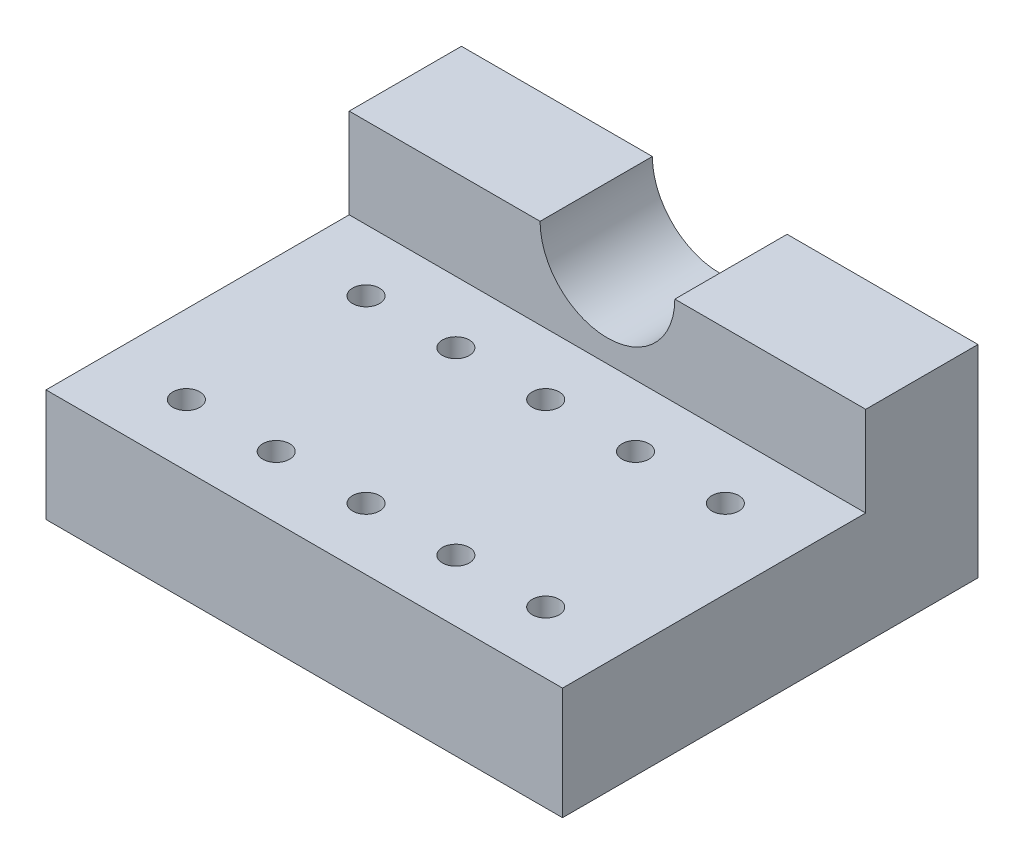
ISO-10303-21;
HEADER;
FILE_DESCRIPTION(('STEP AP214'),'2;1');
FILE_NAME('part.step','',(''),(''),'','','');
FILE_SCHEMA(('AUTOMOTIVE_DESIGN { 1 0 10303 214 1 1 1 1 }'));
ENDSEC;
DATA;
#1=APPLICATION_CONTEXT('core data for automotive mechanical design processes');
#2=APPLICATION_PROTOCOL_DEFINITION('international standard','automotive_design',2000,#1);
#3=PRODUCT_CONTEXT('',#1,'mechanical');
#4=PRODUCT('Part','Part','',(#3));
#5=PRODUCT_RELATED_PRODUCT_CATEGORY('part','',(#4));
#6=PRODUCT_DEFINITION_FORMATION('','',#4);
#7=PRODUCT_DEFINITION_CONTEXT('part definition',#1,'design');
#8=PRODUCT_DEFINITION('design','',#6,#7);
#9=PRODUCT_DEFINITION_SHAPE('','',#8);
#10=(LENGTH_UNIT() NAMED_UNIT(*) SI_UNIT(.MILLI.,.METRE.));
#11=(NAMED_UNIT(*) PLANE_ANGLE_UNIT() SI_UNIT($,.RADIAN.));
#12=(NAMED_UNIT(*) SI_UNIT($,.STERADIAN.) SOLID_ANGLE_UNIT());
#13=UNCERTAINTY_MEASURE_WITH_UNIT(LENGTH_MEASURE(1.E-05),#10,'distance_accuracy_value','');
#14=(GEOMETRIC_REPRESENTATION_CONTEXT(3) GLOBAL_UNCERTAINTY_ASSIGNED_CONTEXT((#13)) GLOBAL_UNIT_ASSIGNED_CONTEXT((#10,
#11,#12)) REPRESENTATION_CONTEXT('',''));
#15=CARTESIAN_POINT('',(0.,0.,0.));
#16=DIRECTION('',(0.,0.,1.));
#17=DIRECTION('',(1.,0.,0.));
#18=AXIS2_PLACEMENT_3D('',#15,#16,#17);
#19=CARTESIAN_POINT('',(23.,18.,13.51));
#20=DIRECTION('',(0.,-1.,0.));
#21=DIRECTION('',(0.,0.,-1.));
#22=AXIS2_PLACEMENT_3D('',#19,#20,#21);
#23=PLANE('',#22);
#24=DIRECTION('',(1.,0.,0.));
#25=VECTOR('',#24,1.);
#26=CARTESIAN_POINT('',(23.,18.,-13.5));
#27=LINE('',#26,#25);
#28=CARTESIAN_POINT('',(-23.,18.,-13.5));
#29=VERTEX_POINT('',#28);
#30=CARTESIAN_POINT('',(-6.,18.,-13.5));
#31=VERTEX_POINT('',#30);
#32=EDGE_CURVE('E213',#29,#31,#27,.T.);
#33=ORIENTED_EDGE('',*,*,#32,.T.);
#34=DIRECTION('',(0.,0.,-1.));
#35=VECTOR('',#34,1.);
#36=CARTESIAN_POINT('',(-6.,18.,6.49999999999999));
#37=LINE('',#36,#35);
#38=CARTESIAN_POINT('',(-6.,18.,-23.5));
#39=VERTEX_POINT('',#38);
#40=EDGE_CURVE('E210',#39,#31,#37,.F.);
#41=ORIENTED_EDGE('',*,*,#40,.F.);
#42=DIRECTION('',(-1.,0.,0.));
#43=VECTOR('',#42,1.);
#44=CARTESIAN_POINT('',(23.,18.,-23.5));
#45=LINE('',#44,#43);
#46=CARTESIAN_POINT('',(-23.,18.,-23.5));
#47=VERTEX_POINT('',#46);
#48=EDGE_CURVE('E11',#39,#47,#45,.T.);
#49=ORIENTED_EDGE('',*,*,#48,.T.);
#50=DIRECTION('',(0.,0.,-1.));
#51=VECTOR('',#50,1.);
#52=CARTESIAN_POINT('',(-23.,18.,13.51));
#53=LINE('',#52,#51);
#54=EDGE_CURVE('E49',#29,#47,#53,.T.);
#55=ORIENTED_EDGE('',*,*,#54,.F.);
#56=EDGE_LOOP('',(#33,#41,#49,#55));
#57=FACE_BOUND('',#56,.T.);
#58=ADVANCED_FACE('F32',(#57),#23,.F.);
#59=CARTESIAN_POINT('',(6.,18.,-13.5));
#60=VERTEX_POINT('',#59);
#61=CARTESIAN_POINT('',(23.,18.,-13.5));
#62=VERTEX_POINT('',#61);
#63=EDGE_CURVE('E36',#60,#62,#27,.T.);
#64=ORIENTED_EDGE('',*,*,#63,.T.);
#65=DIRECTION('',(0.,0.,1.));
#66=VECTOR('',#65,1.);
#67=CARTESIAN_POINT('',(23.,18.,-13.5));
#68=LINE('',#67,#66);
#69=CARTESIAN_POINT('',(23.,18.,-23.5));
#70=VERTEX_POINT('',#69);
#71=EDGE_CURVE('E211',#70,#62,#68,.T.);
#72=ORIENTED_EDGE('',*,*,#71,.F.);
#73=CARTESIAN_POINT('',(6.,18.,-23.5));
#74=VERTEX_POINT('',#73);
#75=EDGE_CURVE('E41',#70,#74,#45,.T.);
#76=ORIENTED_EDGE('',*,*,#75,.T.);
#77=DIRECTION('',(0.,0.,-1.));
#78=VECTOR('',#77,1.);
#79=CARTESIAN_POINT('',(6.,18.,6.49999999999999));
#80=LINE('',#79,#78);
#81=EDGE_CURVE('E208',#60,#74,#80,.T.);
#82=ORIENTED_EDGE('',*,*,#81,.F.);
#83=EDGE_LOOP('',(#64,#72,#76,#82));
#84=FACE_BOUND('',#83,.T.);
#85=ADVANCED_FACE('F34',(#84),#23,.F.);
#86=CARTESIAN_POINT('',(16.0000000000002,10.,8.));
#87=DIRECTION('',(0.,-1.,0.));
#88=DIRECTION('',(0.,0.,-1.));
#89=AXIS2_PLACEMENT_3D('',#86,#87,#88);
#90=CYLINDRICAL_SURFACE('',#89,1.2);
#91=CARTESIAN_POINT('',(16.0000000000002,10.,8.));
#92=DIRECTION('',(0.,1.,0.));
#93=DIRECTION('',(0.,0.,1.));
#94=AXIS2_PLACEMENT_3D('',#91,#92,#93);
#95=CIRCLE('',#94,1.2);
#96=CARTESIAN_POINT('',(16.0000000000002,10.,9.2));
#97=VERTEX_POINT('',#96);
#98=EDGE_CURVE('E131',#97,#97,#95,.T.);
#99=ORIENTED_EDGE('',*,*,#98,.T.);
#100=EDGE_LOOP('',(#99));
#101=FACE_BOUND('',#100,.T.);
#102=CARTESIAN_POINT('',(16.0000000000002,0.,8.));
#103=DIRECTION('',(0.,1.,0.));
#104=DIRECTION('',(0.,0.,1.));
#105=AXIS2_PLACEMENT_3D('',#102,#103,#104);
#106=CIRCLE('',#105,1.2);
#107=CARTESIAN_POINT('',(16.0000000000002,0.,9.2));
#108=VERTEX_POINT('',#107);
#109=EDGE_CURVE('E128',#108,#108,#106,.T.);
#110=ORIENTED_EDGE('',*,*,#109,.F.);
#111=EDGE_LOOP('',(#110));
#112=FACE_BOUND('',#111,.T.);
#113=ADVANCED_FACE('F252',(#101,#112),#90,.F.);
#114=CARTESIAN_POINT('',(8.00000000000016,10.,8.));
#115=DIRECTION('',(0.,-1.,0.));
#116=DIRECTION('',(0.,0.,-1.));
#117=AXIS2_PLACEMENT_3D('',#114,#115,#116);
#118=CYLINDRICAL_SURFACE('',#117,1.2);
#119=CARTESIAN_POINT('',(8.00000000000016,10.,8.));
#120=DIRECTION('',(0.,1.,0.));
#121=DIRECTION('',(0.,0.,1.));
#122=AXIS2_PLACEMENT_3D('',#119,#120,#121);
#123=CIRCLE('',#122,1.2);
#124=CARTESIAN_POINT('',(8.00000000000016,10.,9.2));
#125=VERTEX_POINT('',#124);
#126=EDGE_CURVE('E137',#125,#125,#123,.T.);
#127=ORIENTED_EDGE('',*,*,#126,.T.);
#128=EDGE_LOOP('',(#127));
#129=FACE_BOUND('',#128,.T.);
#130=CARTESIAN_POINT('',(8.00000000000016,0.,8.));
#131=DIRECTION('',(0.,1.,0.));
#132=DIRECTION('',(0.,0.,1.));
#133=AXIS2_PLACEMENT_3D('',#130,#131,#132);
#134=CIRCLE('',#133,1.2);
#135=CARTESIAN_POINT('',(8.00000000000016,0.,9.2));
#136=VERTEX_POINT('',#135);
#137=EDGE_CURVE('E134',#136,#136,#134,.T.);
#138=ORIENTED_EDGE('',*,*,#137,.F.);
#139=EDGE_LOOP('',(#138));
#140=FACE_BOUND('',#139,.T.);
#141=ADVANCED_FACE('F255',(#129,#140),#118,.F.);
#142=CARTESIAN_POINT('',(1.5718276340861E-13,10.,8.));
#143=DIRECTION('',(0.,-1.,0.));
#144=DIRECTION('',(0.,0.,-1.));
#145=AXIS2_PLACEMENT_3D('',#142,#143,#144);
#146=CYLINDRICAL_SURFACE('',#145,1.2);
#147=CARTESIAN_POINT('',(1.5718276340861E-13,10.,8.));
#148=DIRECTION('',(0.,1.,0.));
#149=DIRECTION('',(0.,0.,1.));
#150=AXIS2_PLACEMENT_3D('',#147,#148,#149);
#151=CIRCLE('',#150,1.2);
#152=CARTESIAN_POINT('',(1.5718276340861E-13,10.,9.2));
#153=VERTEX_POINT('',#152);
#154=EDGE_CURVE('E143',#153,#153,#151,.T.);
#155=ORIENTED_EDGE('',*,*,#154,.T.);
#156=EDGE_LOOP('',(#155));
#157=FACE_BOUND('',#156,.T.);
#158=CARTESIAN_POINT('',(1.5718276340861E-13,0.,8.));
#159=DIRECTION('',(0.,1.,0.));
#160=DIRECTION('',(0.,0.,1.));
#161=AXIS2_PLACEMENT_3D('',#158,#159,#160);
#162=CIRCLE('',#161,1.2);
#163=CARTESIAN_POINT('',(1.5718276340861E-13,0.,9.2));
#164=VERTEX_POINT('',#163);
#165=EDGE_CURVE('E140',#164,#164,#162,.T.);
#166=ORIENTED_EDGE('',*,*,#165,.F.);
#167=EDGE_LOOP('',(#166));
#168=FACE_BOUND('',#167,.T.);
#169=ADVANCED_FACE('F286',(#157,#168),#146,.F.);
#170=CARTESIAN_POINT('',(-7.99999999999984,10.,8.));
#171=DIRECTION('',(0.,-1.,0.));
#172=DIRECTION('',(0.,0.,-1.));
#173=AXIS2_PLACEMENT_3D('',#170,#171,#172);
#174=CYLINDRICAL_SURFACE('',#173,1.2);
#175=CARTESIAN_POINT('',(-7.99999999999984,10.,8.));
#176=DIRECTION('',(0.,1.,0.));
#177=DIRECTION('',(0.,0.,1.));
#178=AXIS2_PLACEMENT_3D('',#175,#176,#177);
#179=CIRCLE('',#178,1.2);
#180=CARTESIAN_POINT('',(-7.99999999999984,10.,9.2));
#181=VERTEX_POINT('',#180);
#182=EDGE_CURVE('E149',#181,#181,#179,.T.);
#183=ORIENTED_EDGE('',*,*,#182,.T.);
#184=EDGE_LOOP('',(#183));
#185=FACE_BOUND('',#184,.T.);
#186=CARTESIAN_POINT('',(-7.99999999999984,0.,8.));
#187=DIRECTION('',(0.,1.,0.));
#188=DIRECTION('',(0.,0.,1.));
#189=AXIS2_PLACEMENT_3D('',#186,#187,#188);
#190=CIRCLE('',#189,1.2);
#191=CARTESIAN_POINT('',(-7.99999999999984,0.,9.2));
#192=VERTEX_POINT('',#191);
#193=EDGE_CURVE('E146',#192,#192,#190,.T.);
#194=ORIENTED_EDGE('',*,*,#193,.F.);
#195=EDGE_LOOP('',(#194));
#196=FACE_BOUND('',#195,.T.);
#197=ADVANCED_FACE('F290',(#185,#196),#174,.F.);
#198=CARTESIAN_POINT('',(-15.9999999999998,10.,8.));
#199=DIRECTION('',(0.,-1.,0.));
#200=DIRECTION('',(0.,0.,-1.));
#201=AXIS2_PLACEMENT_3D('',#198,#199,#200);
#202=CYLINDRICAL_SURFACE('',#201,1.2);
#203=CARTESIAN_POINT('',(-15.9999999999998,10.,8.));
#204=DIRECTION('',(0.,1.,0.));
#205=DIRECTION('',(0.,0.,1.));
#206=AXIS2_PLACEMENT_3D('',#203,#204,#205);
#207=CIRCLE('',#206,1.2);
#208=CARTESIAN_POINT('',(-15.9999999999998,10.,9.2));
#209=VERTEX_POINT('',#208);
#210=EDGE_CURVE('E155',#209,#209,#207,.T.);
#211=ORIENTED_EDGE('',*,*,#210,.T.);
#212=EDGE_LOOP('',(#211));
#213=FACE_BOUND('',#212,.T.);
#214=CARTESIAN_POINT('',(-15.9999999999998,0.,8.));
#215=DIRECTION('',(0.,1.,0.));
#216=DIRECTION('',(0.,0.,1.));
#217=AXIS2_PLACEMENT_3D('',#214,#215,#216);
#218=CIRCLE('',#217,1.2);
#219=CARTESIAN_POINT('',(-15.9999999999998,0.,9.2));
#220=VERTEX_POINT('',#219);
#221=EDGE_CURVE('E152',#220,#220,#218,.T.);
#222=ORIENTED_EDGE('',*,*,#221,.F.);
#223=EDGE_LOOP('',(#222));
#224=FACE_BOUND('',#223,.T.);
#225=ADVANCED_FACE('F294',(#213,#224),#202,.F.);
#226=CARTESIAN_POINT('',(16.,10.,-8.));
#227=DIRECTION('',(0.,-1.,0.));
#228=DIRECTION('',(0.,0.,-1.));
#229=AXIS2_PLACEMENT_3D('',#226,#227,#228);
#230=CYLINDRICAL_SURFACE('',#229,1.2);
#231=CARTESIAN_POINT('',(16.,10.,-8.));
#232=DIRECTION('',(0.,1.,0.));
#233=DIRECTION('',(0.,0.,1.));
#234=AXIS2_PLACEMENT_3D('',#231,#232,#233);
#235=CIRCLE('',#234,1.2);
#236=CARTESIAN_POINT('',(16.,10.,-6.8));
#237=VERTEX_POINT('',#236);
#238=EDGE_CURVE('E161',#237,#237,#235,.T.);
#239=ORIENTED_EDGE('',*,*,#238,.T.);
#240=EDGE_LOOP('',(#239));
#241=FACE_BOUND('',#240,.T.);
#242=CARTESIAN_POINT('',(16.,0.,-8.));
#243=DIRECTION('',(0.,1.,0.));
#244=DIRECTION('',(0.,0.,1.));
#245=AXIS2_PLACEMENT_3D('',#242,#243,#244);
#246=CIRCLE('',#245,1.2);
#247=CARTESIAN_POINT('',(16.,0.,-6.8));
#248=VERTEX_POINT('',#247);
#249=EDGE_CURVE('E158',#248,#248,#246,.T.);
#250=ORIENTED_EDGE('',*,*,#249,.F.);
#251=EDGE_LOOP('',(#250));
#252=FACE_BOUND('',#251,.T.);
#253=ADVANCED_FACE('F298',(#241,#252),#230,.F.);
#254=CARTESIAN_POINT('',(7.99999999999999,10.,-8.));
#255=DIRECTION('',(0.,-1.,0.));
#256=DIRECTION('',(0.,0.,-1.));
#257=AXIS2_PLACEMENT_3D('',#254,#255,#256);
#258=CYLINDRICAL_SURFACE('',#257,1.2);
#259=CARTESIAN_POINT('',(7.99999999999999,10.,-8.));
#260=DIRECTION('',(0.,1.,0.));
#261=DIRECTION('',(0.,0.,1.));
#262=AXIS2_PLACEMENT_3D('',#259,#260,#261);
#263=CIRCLE('',#262,1.2);
#264=CARTESIAN_POINT('',(7.99999999999999,10.,-6.8));
#265=VERTEX_POINT('',#264);
#266=EDGE_CURVE('E167',#265,#265,#263,.T.);
#267=ORIENTED_EDGE('',*,*,#266,.T.);
#268=EDGE_LOOP('',(#267));
#269=FACE_BOUND('',#268,.T.);
#270=CARTESIAN_POINT('',(7.99999999999999,0.,-8.));
#271=DIRECTION('',(0.,1.,0.));
#272=DIRECTION('',(0.,0.,1.));
#273=AXIS2_PLACEMENT_3D('',#270,#271,#272);
#274=CIRCLE('',#273,1.2);
#275=CARTESIAN_POINT('',(7.99999999999999,0.,-6.8));
#276=VERTEX_POINT('',#275);
#277=EDGE_CURVE('E164',#276,#276,#274,.T.);
#278=ORIENTED_EDGE('',*,*,#277,.F.);
#279=EDGE_LOOP('',(#278));
#280=FACE_BOUND('',#279,.T.);
#281=ADVANCED_FACE('F302',(#269,#280),#258,.F.);
#282=CARTESIAN_POINT('',(0.,10.,-8.));
#283=DIRECTION('',(0.,-1.,0.));
#284=DIRECTION('',(0.,0.,-1.));
#285=AXIS2_PLACEMENT_3D('',#282,#283,#284);
#286=CYLINDRICAL_SURFACE('',#285,1.2);
#287=CARTESIAN_POINT('',(0.,10.,-8.));
#288=DIRECTION('',(0.,1.,0.));
#289=DIRECTION('',(0.,0.,1.));
#290=AXIS2_PLACEMENT_3D('',#287,#288,#289);
#291=CIRCLE('',#290,1.2);
#292=CARTESIAN_POINT('',(0.,10.,-6.8));
#293=VERTEX_POINT('',#292);
#294=EDGE_CURVE('E173',#293,#293,#291,.T.);
#295=ORIENTED_EDGE('',*,*,#294,.T.);
#296=EDGE_LOOP('',(#295));
#297=FACE_BOUND('',#296,.T.);
#298=CARTESIAN_POINT('',(0.,0.,-8.));
#299=DIRECTION('',(0.,1.,0.));
#300=DIRECTION('',(0.,0.,1.));
#301=AXIS2_PLACEMENT_3D('',#298,#299,#300);
#302=CIRCLE('',#301,1.2);
#303=CARTESIAN_POINT('',(0.,0.,-6.8));
#304=VERTEX_POINT('',#303);
#305=EDGE_CURVE('E170',#304,#304,#302,.T.);
#306=ORIENTED_EDGE('',*,*,#305,.F.);
#307=EDGE_LOOP('',(#306));
#308=FACE_BOUND('',#307,.T.);
#309=ADVANCED_FACE('F306',(#297,#308),#286,.F.);
#310=CARTESIAN_POINT('',(-8.00000000000001,10.,-8.));
#311=DIRECTION('',(0.,-1.,0.));
#312=DIRECTION('',(0.,0.,-1.));
#313=AXIS2_PLACEMENT_3D('',#310,#311,#312);
#314=CYLINDRICAL_SURFACE('',#313,1.2);
#315=CARTESIAN_POINT('',(-8.00000000000001,10.,-8.));
#316=DIRECTION('',(0.,1.,0.));
#317=DIRECTION('',(0.,0.,1.));
#318=AXIS2_PLACEMENT_3D('',#315,#316,#317);
#319=CIRCLE('',#318,1.2);
#320=CARTESIAN_POINT('',(-8.00000000000001,10.,-6.8));
#321=VERTEX_POINT('',#320);
#322=EDGE_CURVE('E179',#321,#321,#319,.T.);
#323=ORIENTED_EDGE('',*,*,#322,.T.);
#324=EDGE_LOOP('',(#323));
#325=FACE_BOUND('',#324,.T.);
#326=CARTESIAN_POINT('',(-8.00000000000001,0.,-8.));
#327=DIRECTION('',(0.,1.,0.));
#328=DIRECTION('',(0.,0.,1.));
#329=AXIS2_PLACEMENT_3D('',#326,#327,#328);
#330=CIRCLE('',#329,1.2);
#331=CARTESIAN_POINT('',(-8.00000000000001,0.,-6.8));
#332=VERTEX_POINT('',#331);
#333=EDGE_CURVE('E176',#332,#332,#330,.T.);
#334=ORIENTED_EDGE('',*,*,#333,.F.);
#335=EDGE_LOOP('',(#334));
#336=FACE_BOUND('',#335,.T.);
#337=ADVANCED_FACE('F310',(#325,#336),#314,.F.);
#338=CARTESIAN_POINT('',(-16.,10.,-8.));
#339=DIRECTION('',(0.,-1.,0.));
#340=DIRECTION('',(0.,0.,-1.));
#341=AXIS2_PLACEMENT_3D('',#338,#339,#340);
#342=CYLINDRICAL_SURFACE('',#341,1.2);
#343=CARTESIAN_POINT('',(-16.,10.,-8.));
#344=DIRECTION('',(0.,1.,0.));
#345=DIRECTION('',(0.,0.,1.));
#346=AXIS2_PLACEMENT_3D('',#343,#344,#345);
#347=CIRCLE('',#346,1.2);
#348=CARTESIAN_POINT('',(-16.,10.,-6.8));
#349=VERTEX_POINT('',#348);
#350=EDGE_CURVE('E114',#349,#349,#347,.T.);
#351=ORIENTED_EDGE('',*,*,#350,.T.);
#352=EDGE_LOOP('',(#351));
#353=FACE_BOUND('',#352,.T.);
#354=CARTESIAN_POINT('',(-16.,0.,-8.));
#355=DIRECTION('',(0.,1.,0.));
#356=DIRECTION('',(0.,0.,1.));
#357=AXIS2_PLACEMENT_3D('',#354,#355,#356);
#358=CIRCLE('',#357,1.2);
#359=CARTESIAN_POINT('',(-16.,0.,-6.8));
#360=VERTEX_POINT('',#359);
#361=EDGE_CURVE('E182',#360,#360,#358,.T.);
#362=ORIENTED_EDGE('',*,*,#361,.F.);
#363=EDGE_LOOP('',(#362));
#364=FACE_BOUND('',#363,.T.);
#365=ADVANCED_FACE('F314',(#353,#364),#342,.F.);
#366=CARTESIAN_POINT('',(-23.,10.,13.5));
#367=DIRECTION('',(0.,0.,-1.));
#368=DIRECTION('',(-1.,0.,0.));
#369=AXIS2_PLACEMENT_3D('',#366,#367,#368);
#370=PLANE('',#369);
#371=DIRECTION('',(1.,0.,0.));
#372=VECTOR('',#371,1.);
#373=CARTESIAN_POINT('',(-23.,0.,13.5));
#374=LINE('',#373,#372);
#375=CARTESIAN_POINT('',(-23.,0.,13.5));
#376=VERTEX_POINT('',#375);
#377=CARTESIAN_POINT('',(23.,0.,13.5));
#378=VERTEX_POINT('',#377);
#379=EDGE_CURVE('E112',#376,#378,#374,.T.);
#380=ORIENTED_EDGE('',*,*,#379,.T.);
#381=DIRECTION('',(0.,-1.,0.));
#382=VECTOR('',#381,1.);
#383=CARTESIAN_POINT('',(23.,10.,13.5));
#384=LINE('',#383,#382);
#385=CARTESIAN_POINT('',(23.,10.,13.5));
#386=VERTEX_POINT('',#385);
#387=EDGE_CURVE('E200',#386,#378,#384,.T.);
#388=ORIENTED_EDGE('',*,*,#387,.F.);
#389=DIRECTION('',(1.,0.,0.));
#390=VECTOR('',#389,1.);
#391=CARTESIAN_POINT('',(-23.,10.,13.5));
#392=LINE('',#391,#390);
#393=CARTESIAN_POINT('',(-23.,10.,13.5));
#394=VERTEX_POINT('',#393);
#395=EDGE_CURVE('E192',#394,#386,#392,.T.);
#396=ORIENTED_EDGE('',*,*,#395,.F.);
#397=DIRECTION('',(0.,-1.,0.));
#398=VECTOR('',#397,1.);
#399=CARTESIAN_POINT('',(-23.,10.,13.5));
#400=LINE('',#399,#398);
#401=EDGE_CURVE('E206',#394,#376,#400,.T.);
#402=ORIENTED_EDGE('',*,*,#401,.T.);
#403=EDGE_LOOP('',(#380,#388,#396,#402));
#404=FACE_BOUND('',#403,.T.);
#405=ADVANCED_FACE('F234',(#404),#370,.F.);
#406=CARTESIAN_POINT('',(0.,10.,0.));
#407=DIRECTION('',(0.,1.,0.));
#408=DIRECTION('',(0.,0.,1.));
#409=AXIS2_PLACEMENT_3D('',#406,#407,#408);
#410=PLANE('',#409);
#411=ORIENTED_EDGE('',*,*,#126,.F.);
#412=EDGE_LOOP('',(#411));
#413=FACE_BOUND('',#412,.T.);
#414=ORIENTED_EDGE('',*,*,#182,.F.);
#415=EDGE_LOOP('',(#414));
#416=FACE_BOUND('',#415,.T.);
#417=ORIENTED_EDGE('',*,*,#238,.F.);
#418=EDGE_LOOP('',(#417));
#419=FACE_BOUND('',#418,.T.);
#420=ORIENTED_EDGE('',*,*,#294,.F.);
#421=EDGE_LOOP('',(#420));
#422=FACE_BOUND('',#421,.T.);
#423=ORIENTED_EDGE('',*,*,#350,.F.);
#424=EDGE_LOOP('',(#423));
#425=FACE_BOUND('',#424,.T.);
#426=DIRECTION('',(0.,0.,1.));
#427=VECTOR('',#426,1.);
#428=CARTESIAN_POINT('',(-23.,10.,-13.5));
#429=LINE('',#428,#427);
#430=CARTESIAN_POINT('',(-23.,10.,-13.5));
#431=VERTEX_POINT('',#430);
#432=EDGE_CURVE('E189',#431,#394,#429,.T.);
#433=ORIENTED_EDGE('',*,*,#432,.T.);
#434=ORIENTED_EDGE('',*,*,#395,.T.);
#435=DIRECTION('',(0.,0.,-1.));
#436=VECTOR('',#435,1.);
#437=CARTESIAN_POINT('',(23.,10.,-13.5));
#438=LINE('',#437,#436);
#439=CARTESIAN_POINT('',(23.,10.,-13.5));
#440=VERTEX_POINT('',#439);
#441=EDGE_CURVE('E195',#386,#440,#438,.T.);
#442=ORIENTED_EDGE('',*,*,#441,.T.);
#443=DIRECTION('',(-1.,0.,0.));
#444=VECTOR('',#443,1.);
#445=CARTESIAN_POINT('',(-23.,10.,-13.5));
#446=LINE('',#445,#444);
#447=EDGE_CURVE('E198',#440,#431,#446,.T.);
#448=ORIENTED_EDGE('',*,*,#447,.T.);
#449=EDGE_LOOP('',(#433,#434,#442,#448));
#450=FACE_BOUND('',#449,.T.);
#451=ORIENTED_EDGE('',*,*,#322,.F.);
#452=EDGE_LOOP('',(#451));
#453=FACE_BOUND('',#452,.T.);
#454=ORIENTED_EDGE('',*,*,#266,.F.);
#455=EDGE_LOOP('',(#454));
#456=FACE_BOUND('',#455,.T.);
#457=ORIENTED_EDGE('',*,*,#210,.F.);
#458=EDGE_LOOP('',(#457));
#459=FACE_BOUND('',#458,.T.);
#460=ORIENTED_EDGE('',*,*,#154,.F.);
#461=EDGE_LOOP('',(#460));
#462=FACE_BOUND('',#461,.T.);
#463=ORIENTED_EDGE('',*,*,#98,.F.);
#464=EDGE_LOOP('',(#463));
#465=FACE_BOUND('',#464,.T.);
#466=ADVANCED_FACE('F237',(#413,#416,#419,#422,#425,#450,#453,#456,#459,#462,#465),#410,.T.);
#467=CARTESIAN_POINT('',(-23.,10.,-13.5));
#468=DIRECTION('',(1.,0.,0.));
#469=DIRECTION('',(0.,0.,-1.));
#470=AXIS2_PLACEMENT_3D('',#467,#468,#469);
#471=PLANE('',#470);
#472=DIRECTION('',(0.,-1.,0.));
#473=VECTOR('',#472,1.);
#474=CARTESIAN_POINT('',(-23.,30.,-13.5));
#475=LINE('',#474,#473);
#476=EDGE_CURVE('E104',#29,#431,#475,.T.);
#477=ORIENTED_EDGE('',*,*,#476,.F.);
#478=ORIENTED_EDGE('',*,*,#54,.T.);
#479=DIRECTION('',(0.,-1.,0.));
#480=VECTOR('',#479,1.);
#481=CARTESIAN_POINT('',(-23.,30.,-23.5));
#482=LINE('',#481,#480);
#483=CARTESIAN_POINT('',(-23.,0.,-23.5));
#484=VERTEX_POINT('',#483);
#485=EDGE_CURVE('E97',#47,#484,#482,.T.);
#486=ORIENTED_EDGE('',*,*,#485,.T.);
#487=DIRECTION('',(0.,0.,1.));
#488=VECTOR('',#487,1.);
#489=CARTESIAN_POINT('',(-23.,0.,-13.5));
#490=LINE('',#489,#488);
#491=EDGE_CURVE('E101',#484,#376,#490,.T.);
#492=ORIENTED_EDGE('',*,*,#491,.T.);
#493=ORIENTED_EDGE('',*,*,#401,.F.);
#494=ORIENTED_EDGE('',*,*,#432,.F.);
#495=EDGE_LOOP('',(#477,#478,#486,#492,#493,#494));
#496=FACE_BOUND('',#495,.T.);
#497=ADVANCED_FACE('F99',(#496),#471,.F.);
#498=CARTESIAN_POINT('',(0.,0.,0.));
#499=DIRECTION('',(0.,1.,0.));
#500=DIRECTION('',(0.,0.,1.));
#501=AXIS2_PLACEMENT_3D('',#498,#499,#500);
#502=PLANE('',#501);
#503=ORIENTED_EDGE('',*,*,#491,.F.);
#504=DIRECTION('',(1.,0.,0.));
#505=VECTOR('',#504,1.);
#506=CARTESIAN_POINT('',(23.,0.,-23.5));
#507=LINE('',#506,#505);
#508=CARTESIAN_POINT('',(23.,0.,-23.5));
#509=VERTEX_POINT('',#508);
#510=EDGE_CURVE('E111',#484,#509,#507,.T.);
#511=ORIENTED_EDGE('',*,*,#510,.T.);
#512=DIRECTION('',(0.,0.,-1.));
#513=VECTOR('',#512,1.);
#514=CARTESIAN_POINT('',(23.,0.,-13.5));
#515=LINE('',#514,#513);
#516=EDGE_CURVE('E193',#378,#509,#515,.T.);
#517=ORIENTED_EDGE('',*,*,#516,.F.);
#518=ORIENTED_EDGE('',*,*,#379,.F.);
#519=EDGE_LOOP('',(#503,#511,#517,#518));
#520=FACE_BOUND('',#519,.T.);
#521=ORIENTED_EDGE('',*,*,#361,.T.);
#522=EDGE_LOOP('',(#521));
#523=FACE_BOUND('',#522,.T.);
#524=ORIENTED_EDGE('',*,*,#333,.T.);
#525=EDGE_LOOP('',(#524));
#526=FACE_BOUND('',#525,.T.);
#527=ORIENTED_EDGE('',*,*,#305,.T.);
#528=EDGE_LOOP('',(#527));
#529=FACE_BOUND('',#528,.T.);
#530=ORIENTED_EDGE('',*,*,#277,.T.);
#531=EDGE_LOOP('',(#530));
#532=FACE_BOUND('',#531,.T.);
#533=ORIENTED_EDGE('',*,*,#249,.T.);
#534=EDGE_LOOP('',(#533));
#535=FACE_BOUND('',#534,.T.);
#536=ORIENTED_EDGE('',*,*,#221,.T.);
#537=EDGE_LOOP('',(#536));
#538=FACE_BOUND('',#537,.T.);
#539=ORIENTED_EDGE('',*,*,#193,.T.);
#540=EDGE_LOOP('',(#539));
#541=FACE_BOUND('',#540,.T.);
#542=ORIENTED_EDGE('',*,*,#165,.T.);
#543=EDGE_LOOP('',(#542));
#544=FACE_BOUND('',#543,.T.);
#545=ORIENTED_EDGE('',*,*,#137,.T.);
#546=EDGE_LOOP('',(#545));
#547=FACE_BOUND('',#546,.T.);
#548=ORIENTED_EDGE('',*,*,#109,.T.);
#549=EDGE_LOOP('',(#548));
#550=FACE_BOUND('',#549,.T.);
#551=ADVANCED_FACE('F108',(#520,#523,#526,#529,#532,#535,#538,#541,#544,#547,#550),#502,.F.);
#552=CARTESIAN_POINT('',(23.,10.,-13.5));
#553=DIRECTION('',(-1.,0.,0.));
#554=DIRECTION('',(0.,0.,1.));
#555=AXIS2_PLACEMENT_3D('',#552,#553,#554);
#556=PLANE('',#555);
#557=DIRECTION('',(0.,-1.,0.));
#558=VECTOR('',#557,1.);
#559=CARTESIAN_POINT('',(23.,30.,-23.5));
#560=LINE('',#559,#558);
#561=EDGE_CURVE('E103',#70,#509,#560,.T.);
#562=ORIENTED_EDGE('',*,*,#561,.F.);
#563=ORIENTED_EDGE('',*,*,#71,.T.);
#564=DIRECTION('',(0.,-1.,0.));
#565=VECTOR('',#564,1.);
#566=CARTESIAN_POINT('',(23.,30.,-13.5));
#567=LINE('',#566,#565);
#568=EDGE_CURVE('E119',#62,#440,#567,.T.);
#569=ORIENTED_EDGE('',*,*,#568,.T.);
#570=ORIENTED_EDGE('',*,*,#441,.F.);
#571=ORIENTED_EDGE('',*,*,#387,.T.);
#572=ORIENTED_EDGE('',*,*,#516,.T.);
#573=EDGE_LOOP('',(#562,#563,#569,#570,#571,#572));
#574=FACE_BOUND('',#573,.T.);
#575=ADVANCED_FACE('F231',(#574),#556,.F.);
#576=CARTESIAN_POINT('',(23.,30.,-13.5));
#577=DIRECTION('',(0.,0.,1.));
#578=DIRECTION('',(1.,0.,0.));
#579=AXIS2_PLACEMENT_3D('',#576,#577,#578);
#580=PLANE('',#579);
#581=ORIENTED_EDGE('',*,*,#32,.F.);
#582=ORIENTED_EDGE('',*,*,#476,.T.);
#583=ORIENTED_EDGE('',*,*,#447,.F.);
#584=ORIENTED_EDGE('',*,*,#568,.F.);
#585=ORIENTED_EDGE('',*,*,#63,.F.);
#586=CARTESIAN_POINT('',(0.,18.,-13.5));
#587=DIRECTION('',(0.,0.,1.));
#588=DIRECTION('',(1.,0.,0.));
#589=AXIS2_PLACEMENT_3D('',#586,#587,#588);
#590=CIRCLE('',#589,6.);
#591=EDGE_CURVE('E120',#31,#60,#590,.T.);
#592=ORIENTED_EDGE('',*,*,#591,.F.);
#593=EDGE_LOOP('',(#581,#582,#583,#584,#585,#592));
#594=FACE_BOUND('',#593,.T.);
#595=ADVANCED_FACE('F227',(#594),#580,.T.);
#596=CARTESIAN_POINT('',(23.,30.,-23.5));
#597=DIRECTION('',(0.,0.,-1.));
#598=DIRECTION('',(-1.,0.,0.));
#599=AXIS2_PLACEMENT_3D('',#596,#597,#598);
#600=PLANE('',#599);
#601=ORIENTED_EDGE('',*,*,#75,.F.);
#602=ORIENTED_EDGE('',*,*,#561,.T.);
#603=ORIENTED_EDGE('',*,*,#510,.F.);
#604=ORIENTED_EDGE('',*,*,#485,.F.);
#605=ORIENTED_EDGE('',*,*,#48,.F.);
#606=CARTESIAN_POINT('',(0.,18.,-23.5));
#607=DIRECTION('',(0.,0.,-1.));
#608=DIRECTION('',(-1.,0.,0.));
#609=AXIS2_PLACEMENT_3D('',#606,#607,#608);
#610=CIRCLE('',#609,6.);
#611=EDGE_CURVE('E124',#74,#39,#610,.T.);
#612=ORIENTED_EDGE('',*,*,#611,.F.);
#613=EDGE_LOOP('',(#601,#602,#603,#604,#605,#612));
#614=FACE_BOUND('',#613,.T.);
#615=ADVANCED_FACE('F116',(#614),#600,.T.);
#616=CARTESIAN_POINT('',(0.,18.,6.49999999999999));
#617=DIRECTION('',(0.,0.,-1.));
#618=DIRECTION('',(-1.,0.,0.));
#619=AXIS2_PLACEMENT_3D('',#616,#617,#618);
#620=CYLINDRICAL_SURFACE('',#619,6.);
#621=ORIENTED_EDGE('',*,*,#611,.T.);
#622=ORIENTED_EDGE('',*,*,#40,.T.);
#623=ORIENTED_EDGE('',*,*,#591,.T.);
#624=ORIENTED_EDGE('',*,*,#81,.T.);
#625=EDGE_LOOP('',(#621,#622,#623,#624));
#626=FACE_BOUND('',#625,.T.);
#627=ADVANCED_FACE('F225',(#626),#620,.F.);
#628=CLOSED_SHELL('',(#58,#85,#113,#141,#169,#197,#225,#253,#281,#309,#337,#365,#405,#466,#497,
#551,#575,#595,#615,#627));
#629=MANIFOLD_SOLID_BREP('B2',#628);
#630=ADVANCED_BREP_SHAPE_REPRESENTATION('',(#18,#629),#14);
#631=SHAPE_DEFINITION_REPRESENTATION(#9,#630);
ENDSEC;
END-ISO-10303-21;
